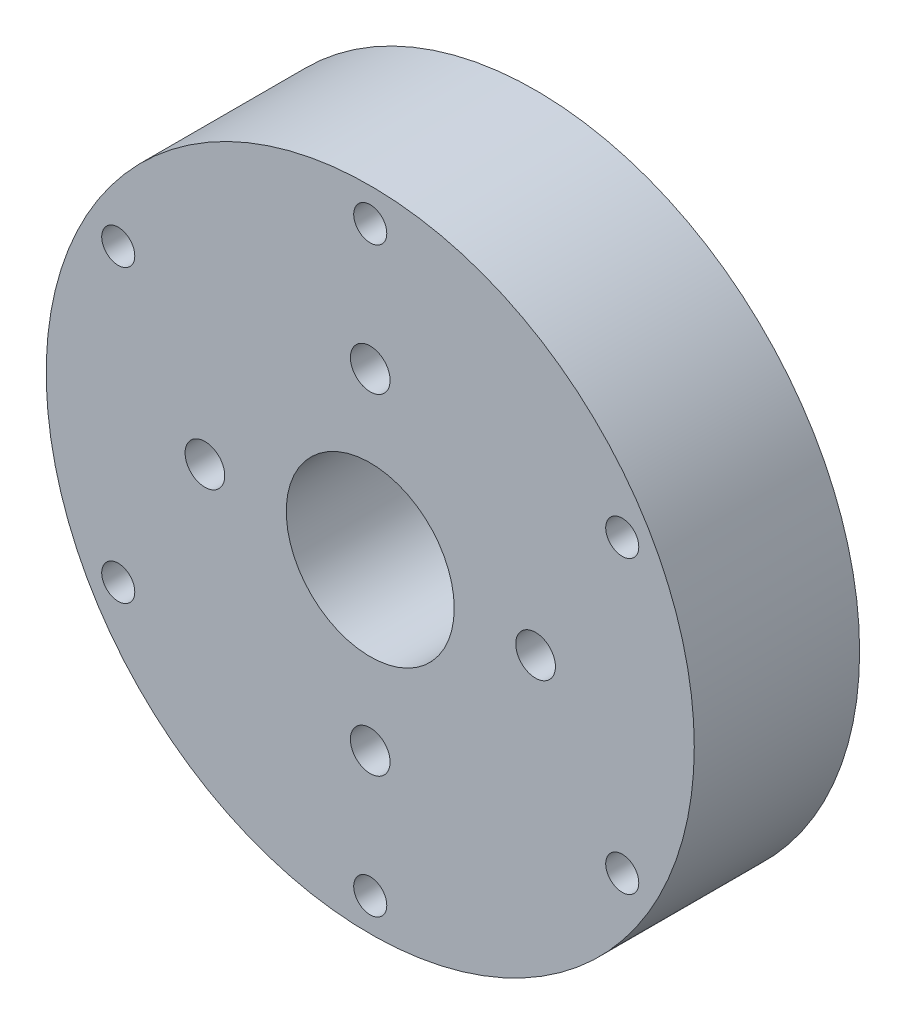
ISO-10303-21;
HEADER;
FILE_DESCRIPTION(('STEP AP214'),'2;1');
FILE_NAME('part.step','',(''),(''),'','','');
FILE_SCHEMA(('AUTOMOTIVE_DESIGN { 1 0 10303 214 1 1 1 1 }'));
ENDSEC;
DATA;
#1=APPLICATION_CONTEXT('core data for automotive mechanical design processes');
#2=APPLICATION_PROTOCOL_DEFINITION('international standard','automotive_design',2000,#1);
#3=PRODUCT_CONTEXT('',#1,'mechanical');
#4=PRODUCT('Part','Part','',(#3));
#5=PRODUCT_RELATED_PRODUCT_CATEGORY('part','',(#4));
#6=PRODUCT_DEFINITION_FORMATION('','',#4);
#7=PRODUCT_DEFINITION_CONTEXT('part definition',#1,'design');
#8=PRODUCT_DEFINITION('design','',#6,#7);
#9=PRODUCT_DEFINITION_SHAPE('','',#8);
#10=(LENGTH_UNIT() NAMED_UNIT(*) SI_UNIT(.MILLI.,.METRE.));
#11=(NAMED_UNIT(*) PLANE_ANGLE_UNIT() SI_UNIT($,.RADIAN.));
#12=(NAMED_UNIT(*) SI_UNIT($,.STERADIAN.) SOLID_ANGLE_UNIT());
#13=UNCERTAINTY_MEASURE_WITH_UNIT(LENGTH_MEASURE(1.E-05),#10,'distance_accuracy_value','');
#14=(GEOMETRIC_REPRESENTATION_CONTEXT(3) GLOBAL_UNCERTAINTY_ASSIGNED_CONTEXT((#13)) GLOBAL_UNIT_ASSIGNED_CONTEXT((#10,
#11,#12)) REPRESENTATION_CONTEXT('',''));
#15=CARTESIAN_POINT('',(0.,0.,0.));
#16=DIRECTION('',(0.,0.,1.));
#17=DIRECTION('',(1.,0.,0.));
#18=AXIS2_PLACEMENT_3D('',#15,#16,#17);
#19=CARTESIAN_POINT('',(0.,0.,12.5));
#20=DIRECTION('',(0.,0.,-1.));
#21=DIRECTION('',(-1.,0.,0.));
#22=AXIS2_PLACEMENT_3D('',#19,#20,#21);
#23=CYLINDRICAL_SURFACE('',#22,24.5);
#24=CARTESIAN_POINT('',(0.,0.,12.5));
#25=DIRECTION('',(0.,0.,1.));
#26=DIRECTION('',(1.,0.,0.));
#27=AXIS2_PLACEMENT_3D('',#24,#25,#26);
#28=CIRCLE('',#27,24.5);
#29=CARTESIAN_POINT('',(24.5,0.,12.5));
#30=VERTEX_POINT('',#29);
#31=EDGE_CURVE('E10',#30,#30,#28,.T.);
#32=ORIENTED_EDGE('',*,*,#31,.F.);
#33=EDGE_LOOP('',(#32));
#34=FACE_BOUND('',#33,.T.);
#35=CARTESIAN_POINT('',(0.,0.,0.));
#36=DIRECTION('',(0.,0.,1.));
#37=DIRECTION('',(1.,0.,0.));
#38=AXIS2_PLACEMENT_3D('',#35,#36,#37);
#39=CIRCLE('',#38,24.5);
#40=CARTESIAN_POINT('',(24.5,0.,0.));
#41=VERTEX_POINT('',#40);
#42=EDGE_CURVE('E43',#41,#41,#39,.T.);
#43=ORIENTED_EDGE('',*,*,#42,.T.);
#44=EDGE_LOOP('',(#43));
#45=FACE_BOUND('',#44,.T.);
#46=ADVANCED_FACE('F40',(#34,#45),#23,.T.);
#47=CARTESIAN_POINT('',(0.,0.,12.5));
#48=DIRECTION('',(0.,0.,1.));
#49=DIRECTION('',(1.,0.,0.));
#50=AXIS2_PLACEMENT_3D('',#47,#48,#49);
#51=PLANE('',#50);
#52=CARTESIAN_POINT('',(0.,0.,12.5));
#53=DIRECTION('',(0.,0.,1.));
#54=DIRECTION('',(1.,0.,0.));
#55=AXIS2_PLACEMENT_3D('',#52,#53,#54);
#56=CIRCLE('',#55,6.35);
#57=CARTESIAN_POINT('',(6.35,0.,12.5));
#58=VERTEX_POINT('',#57);
#59=EDGE_CURVE('E134',#58,#58,#56,.T.);
#60=ORIENTED_EDGE('',*,*,#59,.F.);
#61=EDGE_LOOP('',(#60));
#62=FACE_BOUND('',#61,.T.);
#63=CARTESIAN_POINT('',(0.,12.5,12.5));
#64=DIRECTION('',(0.,0.,1.));
#65=DIRECTION('',(1.,0.,0.));
#66=AXIS2_PLACEMENT_3D('',#63,#64,#65);
#67=CIRCLE('',#66,1.5);
#68=CARTESIAN_POINT('',(1.5,12.5,12.5));
#69=VERTEX_POINT('',#68);
#70=EDGE_CURVE('E127',#69,#69,#67,.T.);
#71=ORIENTED_EDGE('',*,*,#70,.F.);
#72=EDGE_LOOP('',(#71));
#73=FACE_BOUND('',#72,.T.);
#74=CARTESIAN_POINT('',(0.,-12.5,12.5));
#75=DIRECTION('',(0.,0.,1.));
#76=DIRECTION('',(1.,0.,0.));
#77=AXIS2_PLACEMENT_3D('',#74,#75,#76);
#78=CIRCLE('',#77,1.5);
#79=CARTESIAN_POINT('',(1.5,-12.5,12.5));
#80=VERTEX_POINT('',#79);
#81=EDGE_CURVE('E123',#80,#80,#78,.T.);
#82=ORIENTED_EDGE('',*,*,#81,.F.);
#83=EDGE_LOOP('',(#82));
#84=FACE_BOUND('',#83,.T.);
#85=CARTESIAN_POINT('',(12.5,0.,12.5));
#86=DIRECTION('',(0.,0.,1.));
#87=DIRECTION('',(1.,0.,0.));
#88=AXIS2_PLACEMENT_3D('',#85,#86,#87);
#89=CIRCLE('',#88,1.5);
#90=CARTESIAN_POINT('',(14.,0.,12.5));
#91=VERTEX_POINT('',#90);
#92=EDGE_CURVE('E115',#91,#91,#89,.T.);
#93=ORIENTED_EDGE('',*,*,#92,.F.);
#94=EDGE_LOOP('',(#93));
#95=FACE_BOUND('',#94,.T.);
#96=CARTESIAN_POINT('',(-12.5,0.,12.5));
#97=DIRECTION('',(0.,0.,1.));
#98=DIRECTION('',(1.,0.,0.));
#99=AXIS2_PLACEMENT_3D('',#96,#97,#98);
#100=CIRCLE('',#99,1.5);
#101=CARTESIAN_POINT('',(-11.,0.,12.5));
#102=VERTEX_POINT('',#101);
#103=EDGE_CURVE('E106',#102,#102,#100,.T.);
#104=ORIENTED_EDGE('',*,*,#103,.F.);
#105=EDGE_LOOP('',(#104));
#106=FACE_BOUND('',#105,.T.);
#107=CARTESIAN_POINT('',(0.,-22.,12.5));
#108=DIRECTION('',(0.,0.,1.));
#109=DIRECTION('',(1.,0.,0.));
#110=AXIS2_PLACEMENT_3D('',#107,#108,#109);
#111=CIRCLE('',#110,1.25);
#112=CARTESIAN_POINT('',(1.25,-22.,12.5));
#113=VERTEX_POINT('',#112);
#114=EDGE_CURVE('E71',#113,#113,#111,.T.);
#115=ORIENTED_EDGE('',*,*,#114,.F.);
#116=EDGE_LOOP('',(#115));
#117=FACE_BOUND('',#116,.T.);
#118=CARTESIAN_POINT('',(-19.0525588832576,-11.0000000000001,12.5));
#119=DIRECTION('',(0.,0.,1.));
#120=DIRECTION('',(1.,0.,0.));
#121=AXIS2_PLACEMENT_3D('',#118,#119,#120);
#122=CIRCLE('',#121,1.25);
#123=CARTESIAN_POINT('',(-17.8025588832576,-11.0000000000001,12.5));
#124=VERTEX_POINT('',#123);
#125=EDGE_CURVE('E77',#124,#124,#122,.T.);
#126=ORIENTED_EDGE('',*,*,#125,.F.);
#127=EDGE_LOOP('',(#126));
#128=FACE_BOUND('',#127,.T.);
#129=CARTESIAN_POINT('',(0.,22.,12.5));
#130=DIRECTION('',(0.,0.,1.));
#131=DIRECTION('',(1.,0.,0.));
#132=AXIS2_PLACEMENT_3D('',#129,#130,#131);
#133=CIRCLE('',#132,1.25);
#134=CARTESIAN_POINT('',(1.25,22.,12.5));
#135=VERTEX_POINT('',#134);
#136=EDGE_CURVE('E67',#135,#135,#133,.T.);
#137=ORIENTED_EDGE('',*,*,#136,.F.);
#138=EDGE_LOOP('',(#137));
#139=FACE_BOUND('',#138,.T.);
#140=CARTESIAN_POINT('',(19.0525588832577,11.,12.5));
#141=DIRECTION('',(0.,0.,1.));
#142=DIRECTION('',(1.,0.,0.));
#143=AXIS2_PLACEMENT_3D('',#140,#141,#142);
#144=CIRCLE('',#143,1.25);
#145=CARTESIAN_POINT('',(20.3025588832577,11.,12.5));
#146=VERTEX_POINT('',#145);
#147=EDGE_CURVE('E58',#146,#146,#144,.T.);
#148=ORIENTED_EDGE('',*,*,#147,.F.);
#149=EDGE_LOOP('',(#148));
#150=FACE_BOUND('',#149,.T.);
#151=CARTESIAN_POINT('',(-19.0525588832576,11.0000000000001,12.5));
#152=DIRECTION('',(0.,0.,1.));
#153=DIRECTION('',(1.,0.,0.));
#154=AXIS2_PLACEMENT_3D('',#151,#152,#153);
#155=CIRCLE('',#154,1.25);
#156=CARTESIAN_POINT('',(-17.8025588832576,11.0000000000001,12.5));
#157=VERTEX_POINT('',#156);
#158=EDGE_CURVE('E59',#157,#157,#155,.T.);
#159=ORIENTED_EDGE('',*,*,#158,.F.);
#160=EDGE_LOOP('',(#159));
#161=FACE_BOUND('',#160,.T.);
#162=CARTESIAN_POINT('',(19.0525588832577,-10.9999999999999,12.5));
#163=DIRECTION('',(0.,0.,1.));
#164=DIRECTION('',(1.,0.,0.));
#165=AXIS2_PLACEMENT_3D('',#162,#163,#164);
#166=CIRCLE('',#165,1.25);
#167=CARTESIAN_POINT('',(20.3025588832577,-10.9999999999999,12.5));
#168=VERTEX_POINT('',#167);
#169=EDGE_CURVE('E76',#168,#168,#166,.T.);
#170=ORIENTED_EDGE('',*,*,#169,.F.);
#171=EDGE_LOOP('',(#170));
#172=FACE_BOUND('',#171,.T.);
#173=ORIENTED_EDGE('',*,*,#31,.T.);
#174=EDGE_LOOP('',(#173));
#175=FACE_BOUND('',#174,.T.);
#176=ADVANCED_FACE('F151',(#62,#73,#84,#95,#106,#117,#128,#139,#150,#161,#172,#175),#51,.T.);
#177=CARTESIAN_POINT('',(0.,0.,0.));
#178=DIRECTION('',(0.,0.,1.));
#179=DIRECTION('',(1.,0.,0.));
#180=AXIS2_PLACEMENT_3D('',#177,#178,#179);
#181=PLANE('',#180);
#182=ORIENTED_EDGE('',*,*,#42,.F.);
#183=EDGE_LOOP('',(#182));
#184=FACE_BOUND('',#183,.T.);
#185=ADVANCED_FACE('F154',(#184),#181,.F.);
#186=CARTESIAN_POINT('',(19.0525588832577,-10.9999999999999,9.5));
#187=DIRECTION('',(0.,0.,1.));
#188=DIRECTION('',(1.,0.,0.));
#189=AXIS2_PLACEMENT_3D('',#186,#187,#188);
#190=CYLINDRICAL_SURFACE('',#189,1.25);
#191=CARTESIAN_POINT('',(19.0525588832577,-10.9999999999999,9.5));
#192=DIRECTION('',(0.,0.,1.));
#193=DIRECTION('',(1.,0.,0.));
#194=AXIS2_PLACEMENT_3D('',#191,#192,#193);
#195=CIRCLE('',#194,1.25);
#196=CARTESIAN_POINT('',(20.3025588832577,-10.9999999999999,9.5));
#197=VERTEX_POINT('',#196);
#198=EDGE_CURVE('E72',#197,#197,#195,.T.);
#199=ORIENTED_EDGE('',*,*,#198,.F.);
#200=EDGE_LOOP('',(#199));
#201=FACE_BOUND('',#200,.T.);
#202=ORIENTED_EDGE('',*,*,#169,.T.);
#203=EDGE_LOOP('',(#202));
#204=FACE_BOUND('',#203,.T.);
#205=ADVANCED_FACE('F176',(#201,#204),#190,.F.);
#206=CARTESIAN_POINT('',(19.0525588832577,-10.9999999999999,9.5));
#207=DIRECTION('',(0.,0.,1.));
#208=DIRECTION('',(1.,0.,0.));
#209=AXIS2_PLACEMENT_3D('',#206,#207,#208);
#210=PLANE('',#209);
#211=ORIENTED_EDGE('',*,*,#198,.T.);
#212=EDGE_LOOP('',(#211));
#213=FACE_BOUND('',#212,.T.);
#214=ADVANCED_FACE('F178',(#213),#210,.T.);
#215=CARTESIAN_POINT('',(-19.0525588832576,11.0000000000001,9.5));
#216=DIRECTION('',(0.,0.,1.));
#217=DIRECTION('',(1.,0.,0.));
#218=AXIS2_PLACEMENT_3D('',#215,#216,#217);
#219=CYLINDRICAL_SURFACE('',#218,1.25);
#220=CARTESIAN_POINT('',(-19.0525588832576,11.0000000000001,9.5));
#221=DIRECTION('',(0.,0.,1.));
#222=DIRECTION('',(1.,0.,0.));
#223=AXIS2_PLACEMENT_3D('',#220,#221,#222);
#224=CIRCLE('',#223,1.25);
#225=CARTESIAN_POINT('',(-17.8025588832576,11.0000000000001,9.5));
#226=VERTEX_POINT('',#225);
#227=EDGE_CURVE('E81',#226,#226,#224,.T.);
#228=ORIENTED_EDGE('',*,*,#227,.F.);
#229=EDGE_LOOP('',(#228));
#230=FACE_BOUND('',#229,.T.);
#231=ORIENTED_EDGE('',*,*,#158,.T.);
#232=EDGE_LOOP('',(#231));
#233=FACE_BOUND('',#232,.T.);
#234=ADVANCED_FACE('F185',(#230,#233),#219,.F.);
#235=CARTESIAN_POINT('',(-19.0525588832576,11.0000000000001,9.5));
#236=DIRECTION('',(0.,0.,1.));
#237=DIRECTION('',(1.,0.,0.));
#238=AXIS2_PLACEMENT_3D('',#235,#236,#237);
#239=PLANE('',#238);
#240=ORIENTED_EDGE('',*,*,#227,.T.);
#241=EDGE_LOOP('',(#240));
#242=FACE_BOUND('',#241,.T.);
#243=ADVANCED_FACE('F229',(#242),#239,.T.);
#244=CARTESIAN_POINT('',(19.0525588832577,11.,9.5));
#245=DIRECTION('',(0.,0.,1.));
#246=DIRECTION('',(1.,0.,0.));
#247=AXIS2_PLACEMENT_3D('',#244,#245,#246);
#248=CYLINDRICAL_SURFACE('',#247,1.25);
#249=CARTESIAN_POINT('',(19.0525588832577,11.,9.5));
#250=DIRECTION('',(0.,0.,1.));
#251=DIRECTION('',(1.,0.,0.));
#252=AXIS2_PLACEMENT_3D('',#249,#250,#251);
#253=CIRCLE('',#252,1.25);
#254=CARTESIAN_POINT('',(20.3025588832577,11.,9.5));
#255=VERTEX_POINT('',#254);
#256=EDGE_CURVE('E54',#255,#255,#253,.T.);
#257=ORIENTED_EDGE('',*,*,#256,.F.);
#258=EDGE_LOOP('',(#257));
#259=FACE_BOUND('',#258,.T.);
#260=ORIENTED_EDGE('',*,*,#147,.T.);
#261=EDGE_LOOP('',(#260));
#262=FACE_BOUND('',#261,.T.);
#263=ADVANCED_FACE('F240',(#259,#262),#248,.F.);
#264=CARTESIAN_POINT('',(19.0525588832577,11.,9.5));
#265=DIRECTION('',(0.,0.,1.));
#266=DIRECTION('',(1.,0.,0.));
#267=AXIS2_PLACEMENT_3D('',#264,#265,#266);
#268=PLANE('',#267);
#269=ORIENTED_EDGE('',*,*,#256,.T.);
#270=EDGE_LOOP('',(#269));
#271=FACE_BOUND('',#270,.T.);
#272=ADVANCED_FACE('F250',(#271),#268,.T.);
#273=CARTESIAN_POINT('',(0.,22.,9.5));
#274=DIRECTION('',(0.,0.,1.));
#275=DIRECTION('',(1.,0.,0.));
#276=AXIS2_PLACEMENT_3D('',#273,#274,#275);
#277=CYLINDRICAL_SURFACE('',#276,1.25);
#278=CARTESIAN_POINT('',(0.,22.,9.5));
#279=DIRECTION('',(0.,0.,1.));
#280=DIRECTION('',(1.,0.,0.));
#281=AXIS2_PLACEMENT_3D('',#278,#279,#280);
#282=CIRCLE('',#281,1.25);
#283=CARTESIAN_POINT('',(1.25,22.,9.5));
#284=VERTEX_POINT('',#283);
#285=EDGE_CURVE('E63',#284,#284,#282,.T.);
#286=ORIENTED_EDGE('',*,*,#285,.F.);
#287=EDGE_LOOP('',(#286));
#288=FACE_BOUND('',#287,.T.);
#289=ORIENTED_EDGE('',*,*,#136,.T.);
#290=EDGE_LOOP('',(#289));
#291=FACE_BOUND('',#290,.T.);
#292=ADVANCED_FACE('F261',(#288,#291),#277,.F.);
#293=CARTESIAN_POINT('',(0.,22.,9.5));
#294=DIRECTION('',(0.,0.,1.));
#295=DIRECTION('',(1.,0.,0.));
#296=AXIS2_PLACEMENT_3D('',#293,#294,#295);
#297=PLANE('',#296);
#298=ORIENTED_EDGE('',*,*,#285,.T.);
#299=EDGE_LOOP('',(#298));
#300=FACE_BOUND('',#299,.T.);
#301=ADVANCED_FACE('F272',(#300),#297,.T.);
#302=CARTESIAN_POINT('',(-19.0525588832576,-11.0000000000001,9.5));
#303=DIRECTION('',(0.,0.,1.));
#304=DIRECTION('',(1.,0.,0.));
#305=AXIS2_PLACEMENT_3D('',#302,#303,#304);
#306=CYLINDRICAL_SURFACE('',#305,1.25);
#307=CARTESIAN_POINT('',(-19.0525588832576,-11.0000000000001,9.5));
#308=DIRECTION('',(0.,0.,1.));
#309=DIRECTION('',(1.,0.,0.));
#310=AXIS2_PLACEMENT_3D('',#307,#308,#309);
#311=CIRCLE('',#310,1.25);
#312=CARTESIAN_POINT('',(-17.8025588832576,-11.0000000000001,9.5));
#313=VERTEX_POINT('',#312);
#314=EDGE_CURVE('E88',#313,#313,#311,.T.);
#315=ORIENTED_EDGE('',*,*,#314,.F.);
#316=EDGE_LOOP('',(#315));
#317=FACE_BOUND('',#316,.T.);
#318=ORIENTED_EDGE('',*,*,#125,.T.);
#319=EDGE_LOOP('',(#318));
#320=FACE_BOUND('',#319,.T.);
#321=ADVANCED_FACE('F283',(#317,#320),#306,.F.);
#322=CARTESIAN_POINT('',(-19.0525588832576,-11.0000000000001,9.5));
#323=DIRECTION('',(0.,0.,1.));
#324=DIRECTION('',(1.,0.,0.));
#325=AXIS2_PLACEMENT_3D('',#322,#323,#324);
#326=PLANE('',#325);
#327=ORIENTED_EDGE('',*,*,#314,.T.);
#328=EDGE_LOOP('',(#327));
#329=FACE_BOUND('',#328,.T.);
#330=ADVANCED_FACE('F294',(#329),#326,.T.);
#331=CARTESIAN_POINT('',(0.,-22.,9.5));
#332=DIRECTION('',(0.,0.,1.));
#333=DIRECTION('',(1.,0.,0.));
#334=AXIS2_PLACEMENT_3D('',#331,#332,#333);
#335=CYLINDRICAL_SURFACE('',#334,1.25);
#336=CARTESIAN_POINT('',(0.,-22.,9.5));
#337=DIRECTION('',(0.,0.,1.));
#338=DIRECTION('',(1.,0.,0.));
#339=AXIS2_PLACEMENT_3D('',#336,#337,#338);
#340=CIRCLE('',#339,1.25);
#341=CARTESIAN_POINT('',(1.25,-22.,9.5));
#342=VERTEX_POINT('',#341);
#343=EDGE_CURVE('E52',#342,#342,#340,.T.);
#344=ORIENTED_EDGE('',*,*,#343,.F.);
#345=EDGE_LOOP('',(#344));
#346=FACE_BOUND('',#345,.T.);
#347=ORIENTED_EDGE('',*,*,#114,.T.);
#348=EDGE_LOOP('',(#347));
#349=FACE_BOUND('',#348,.T.);
#350=ADVANCED_FACE('F305',(#346,#349),#335,.F.);
#351=CARTESIAN_POINT('',(0.,-22.,9.5));
#352=DIRECTION('',(0.,0.,1.));
#353=DIRECTION('',(1.,0.,0.));
#354=AXIS2_PLACEMENT_3D('',#351,#352,#353);
#355=PLANE('',#354);
#356=ORIENTED_EDGE('',*,*,#343,.T.);
#357=EDGE_LOOP('',(#356));
#358=FACE_BOUND('',#357,.T.);
#359=ADVANCED_FACE('F316',(#358),#355,.T.);
#360=CARTESIAN_POINT('',(-12.5,0.,9.));
#361=DIRECTION('',(0.,0.,1.));
#362=DIRECTION('',(1.,0.,0.));
#363=AXIS2_PLACEMENT_3D('',#360,#361,#362);
#364=CYLINDRICAL_SURFACE('',#363,1.5);
#365=CARTESIAN_POINT('',(-12.5,0.,9.));
#366=DIRECTION('',(0.,0.,1.));
#367=DIRECTION('',(1.,0.,0.));
#368=AXIS2_PLACEMENT_3D('',#365,#366,#367);
#369=CIRCLE('',#368,1.5);
#370=CARTESIAN_POINT('',(-11.,0.,9.));
#371=VERTEX_POINT('',#370);
#372=EDGE_CURVE('E102',#371,#371,#369,.T.);
#373=ORIENTED_EDGE('',*,*,#372,.F.);
#374=EDGE_LOOP('',(#373));
#375=FACE_BOUND('',#374,.T.);
#376=ORIENTED_EDGE('',*,*,#103,.T.);
#377=EDGE_LOOP('',(#376));
#378=FACE_BOUND('',#377,.T.);
#379=ADVANCED_FACE('F327',(#375,#378),#364,.F.);
#380=CARTESIAN_POINT('',(-12.5,0.,9.));
#381=DIRECTION('',(0.,0.,1.));
#382=DIRECTION('',(1.,0.,0.));
#383=AXIS2_PLACEMENT_3D('',#380,#381,#382);
#384=PLANE('',#383);
#385=ORIENTED_EDGE('',*,*,#372,.T.);
#386=EDGE_LOOP('',(#385));
#387=FACE_BOUND('',#386,.T.);
#388=ADVANCED_FACE('F338',(#387),#384,.T.);
#389=CARTESIAN_POINT('',(12.5,0.,9.));
#390=DIRECTION('',(0.,0.,1.));
#391=DIRECTION('',(1.,0.,0.));
#392=AXIS2_PLACEMENT_3D('',#389,#390,#391);
#393=CYLINDRICAL_SURFACE('',#392,1.5);
#394=CARTESIAN_POINT('',(12.5,0.,9.));
#395=DIRECTION('',(0.,0.,1.));
#396=DIRECTION('',(1.,0.,0.));
#397=AXIS2_PLACEMENT_3D('',#394,#395,#396);
#398=CIRCLE('',#397,1.5);
#399=CARTESIAN_POINT('',(14.,0.,9.));
#400=VERTEX_POINT('',#399);
#401=EDGE_CURVE('E111',#400,#400,#398,.T.);
#402=ORIENTED_EDGE('',*,*,#401,.F.);
#403=EDGE_LOOP('',(#402));
#404=FACE_BOUND('',#403,.T.);
#405=ORIENTED_EDGE('',*,*,#92,.T.);
#406=EDGE_LOOP('',(#405));
#407=FACE_BOUND('',#406,.T.);
#408=ADVANCED_FACE('F349',(#404,#407),#393,.F.);
#409=CARTESIAN_POINT('',(12.5,0.,9.));
#410=DIRECTION('',(0.,0.,1.));
#411=DIRECTION('',(1.,0.,0.));
#412=AXIS2_PLACEMENT_3D('',#409,#410,#411);
#413=PLANE('',#412);
#414=ORIENTED_EDGE('',*,*,#401,.T.);
#415=EDGE_LOOP('',(#414));
#416=FACE_BOUND('',#415,.T.);
#417=ADVANCED_FACE('F360',(#416),#413,.T.);
#418=CARTESIAN_POINT('',(0.,-12.5,9.));
#419=DIRECTION('',(0.,0.,1.));
#420=DIRECTION('',(1.,0.,0.));
#421=AXIS2_PLACEMENT_3D('',#418,#419,#420);
#422=CYLINDRICAL_SURFACE('',#421,1.5);
#423=CARTESIAN_POINT('',(0.,-12.5,9.));
#424=DIRECTION('',(0.,0.,1.));
#425=DIRECTION('',(1.,0.,0.));
#426=AXIS2_PLACEMENT_3D('',#423,#424,#425);
#427=CIRCLE('',#426,1.5);
#428=CARTESIAN_POINT('',(1.5,-12.5,9.));
#429=VERTEX_POINT('',#428);
#430=EDGE_CURVE('E119',#429,#429,#427,.T.);
#431=ORIENTED_EDGE('',*,*,#430,.F.);
#432=EDGE_LOOP('',(#431));
#433=FACE_BOUND('',#432,.T.);
#434=ORIENTED_EDGE('',*,*,#81,.T.);
#435=EDGE_LOOP('',(#434));
#436=FACE_BOUND('',#435,.T.);
#437=ADVANCED_FACE('F371',(#433,#436),#422,.F.);
#438=CARTESIAN_POINT('',(0.,-12.5,9.));
#439=DIRECTION('',(0.,0.,1.));
#440=DIRECTION('',(1.,0.,0.));
#441=AXIS2_PLACEMENT_3D('',#438,#439,#440);
#442=PLANE('',#441);
#443=ORIENTED_EDGE('',*,*,#430,.T.);
#444=EDGE_LOOP('',(#443));
#445=FACE_BOUND('',#444,.T.);
#446=ADVANCED_FACE('F382',(#445),#442,.T.);
#447=CARTESIAN_POINT('',(0.,12.5,9.));
#448=DIRECTION('',(0.,0.,1.));
#449=DIRECTION('',(1.,0.,0.));
#450=AXIS2_PLACEMENT_3D('',#447,#448,#449);
#451=CYLINDRICAL_SURFACE('',#450,1.5);
#452=CARTESIAN_POINT('',(0.,12.5,9.));
#453=DIRECTION('',(0.,0.,1.));
#454=DIRECTION('',(1.,0.,0.));
#455=AXIS2_PLACEMENT_3D('',#452,#453,#454);
#456=CIRCLE('',#455,1.5);
#457=CARTESIAN_POINT('',(1.5,12.5,9.));
#458=VERTEX_POINT('',#457);
#459=EDGE_CURVE('E92',#458,#458,#456,.T.);
#460=ORIENTED_EDGE('',*,*,#459,.F.);
#461=EDGE_LOOP('',(#460));
#462=FACE_BOUND('',#461,.T.);
#463=ORIENTED_EDGE('',*,*,#70,.T.);
#464=EDGE_LOOP('',(#463));
#465=FACE_BOUND('',#464,.T.);
#466=ADVANCED_FACE('F393',(#462,#465),#451,.F.);
#467=CARTESIAN_POINT('',(0.,12.5,9.));
#468=DIRECTION('',(0.,0.,1.));
#469=DIRECTION('',(1.,0.,0.));
#470=AXIS2_PLACEMENT_3D('',#467,#468,#469);
#471=PLANE('',#470);
#472=ORIENTED_EDGE('',*,*,#459,.T.);
#473=EDGE_LOOP('',(#472));
#474=FACE_BOUND('',#473,.T.);
#475=ADVANCED_FACE('F147',(#474),#471,.T.);
#476=CARTESIAN_POINT('',(0.,0.,2.5));
#477=DIRECTION('',(0.,0.,1.));
#478=DIRECTION('',(1.,0.,0.));
#479=AXIS2_PLACEMENT_3D('',#476,#477,#478);
#480=CYLINDRICAL_SURFACE('',#479,6.35);
#481=CARTESIAN_POINT('',(0.,0.,2.5));
#482=DIRECTION('',(0.,0.,1.));
#483=DIRECTION('',(1.,0.,0.));
#484=AXIS2_PLACEMENT_3D('',#481,#482,#483);
#485=CIRCLE('',#484,6.35);
#486=CARTESIAN_POINT('',(6.35,0.,2.5));
#487=VERTEX_POINT('',#486);
#488=EDGE_CURVE('E107',#487,#487,#485,.T.);
#489=ORIENTED_EDGE('',*,*,#488,.F.);
#490=EDGE_LOOP('',(#489));
#491=FACE_BOUND('',#490,.T.);
#492=ORIENTED_EDGE('',*,*,#59,.T.);
#493=EDGE_LOOP('',(#492));
#494=FACE_BOUND('',#493,.T.);
#495=ADVANCED_FACE('F144',(#491,#494),#480,.F.);
#496=CARTESIAN_POINT('',(0.,0.,2.5));
#497=DIRECTION('',(0.,0.,1.));
#498=DIRECTION('',(1.,0.,0.));
#499=AXIS2_PLACEMENT_3D('',#496,#497,#498);
#500=PLANE('',#499);
#501=ORIENTED_EDGE('',*,*,#488,.T.);
#502=EDGE_LOOP('',(#501));
#503=FACE_BOUND('',#502,.T.);
#504=ADVANCED_FACE('F142',(#503),#500,.T.);
#505=CLOSED_SHELL('',(#46,#176,#185,#205,#214,#234,#243,#263,#272,#292,#301,#321,#330,#350,#359,
#379,#388,#408,#417,#437,#446,#466,#475,#495,#504));
#506=MANIFOLD_SOLID_BREP('B2',#505);
#507=ADVANCED_BREP_SHAPE_REPRESENTATION('',(#18,#506),#14);
#508=SHAPE_DEFINITION_REPRESENTATION(#9,#507);
ENDSEC;
END-ISO-10303-21;
